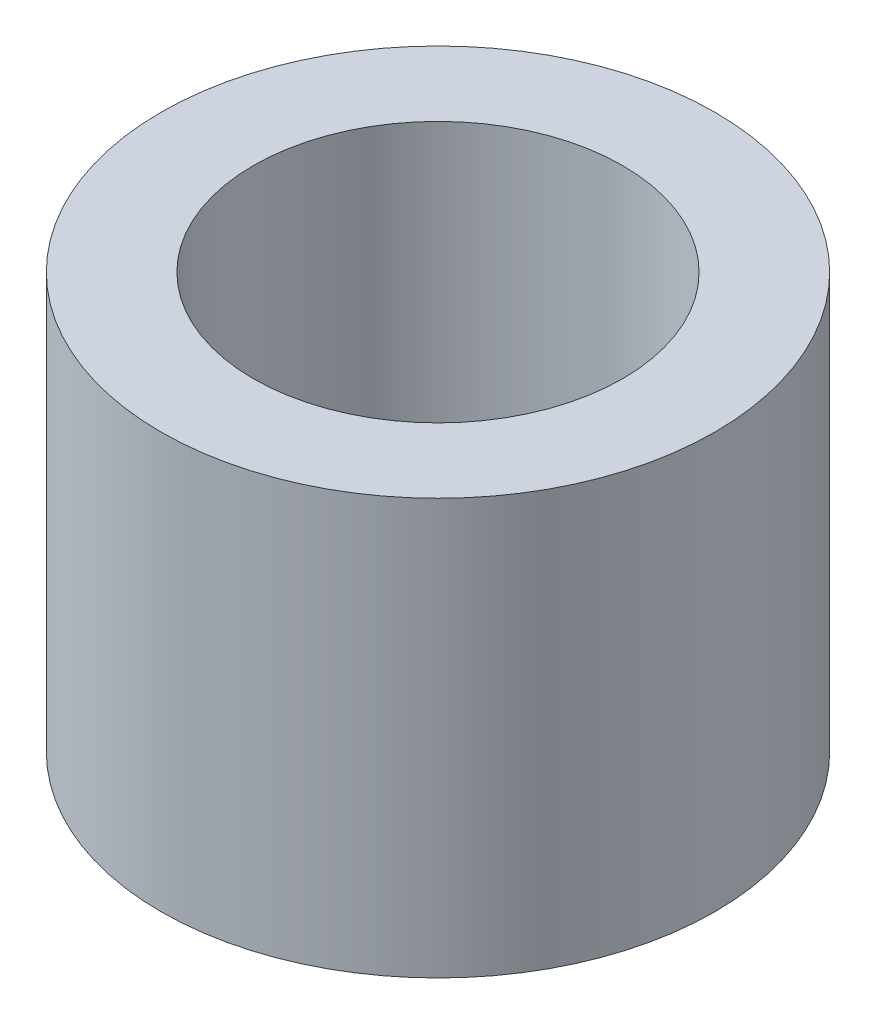
ISO-10303-21;
HEADER;
FILE_DESCRIPTION(('STEP AP214'),'2;1');
FILE_NAME('part.step','',(''),(''),'','','');
FILE_SCHEMA(('AUTOMOTIVE_DESIGN { 1 0 10303 214 1 1 1 1 }'));
ENDSEC;
DATA;
#1=APPLICATION_CONTEXT('core data for automotive mechanical design processes');
#2=APPLICATION_PROTOCOL_DEFINITION('international standard','automotive_design',2000,#1);
#3=PRODUCT_CONTEXT('',#1,'mechanical');
#4=PRODUCT('Part','Part','',(#3));
#5=PRODUCT_RELATED_PRODUCT_CATEGORY('part','',(#4));
#6=PRODUCT_DEFINITION_FORMATION('','',#4);
#7=PRODUCT_DEFINITION_CONTEXT('part definition',#1,'design');
#8=PRODUCT_DEFINITION('design','',#6,#7);
#9=PRODUCT_DEFINITION_SHAPE('','',#8);
#10=(LENGTH_UNIT() NAMED_UNIT(*) SI_UNIT(.MILLI.,.METRE.));
#11=(NAMED_UNIT(*) PLANE_ANGLE_UNIT() SI_UNIT($,.RADIAN.));
#12=(NAMED_UNIT(*) SI_UNIT($,.STERADIAN.) SOLID_ANGLE_UNIT());
#13=UNCERTAINTY_MEASURE_WITH_UNIT(LENGTH_MEASURE(1.E-05),#10,'distance_accuracy_value','');
#14=(GEOMETRIC_REPRESENTATION_CONTEXT(3) GLOBAL_UNCERTAINTY_ASSIGNED_CONTEXT((#13)) GLOBAL_UNIT_ASSIGNED_CONTEXT((#10,
#11,#12)) REPRESENTATION_CONTEXT('',''));
#15=CARTESIAN_POINT('',(0.,0.,0.));
#16=DIRECTION('',(0.,0.,1.));
#17=DIRECTION('',(1.,0.,0.));
#18=AXIS2_PLACEMENT_3D('',#15,#16,#17);
#19=CARTESIAN_POINT('',(0.,4.5,0.));
#20=DIRECTION('',(0.,1.,0.));
#21=DIRECTION('',(0.,0.,1.));
#22=AXIS2_PLACEMENT_3D('',#19,#20,#21);
#23=PLANE('',#22);
#24=CARTESIAN_POINT('',(0.,4.5,0.));
#25=DIRECTION('',(0.,1.,0.));
#26=DIRECTION('',(0.,0.,1.));
#27=AXIS2_PLACEMENT_3D('',#24,#25,#26);
#28=CIRCLE('',#27,3.);
#29=CARTESIAN_POINT('',(0.,4.5,3.));
#30=VERTEX_POINT('',#29);
#31=EDGE_CURVE('E10',#30,#30,#28,.T.);
#32=ORIENTED_EDGE('',*,*,#31,.T.);
#33=EDGE_LOOP('',(#32));
#34=FACE_BOUND('',#33,.T.);
#35=CARTESIAN_POINT('',(0.,4.5,0.));
#36=DIRECTION('',(0.,1.,0.));
#37=DIRECTION('',(0.,0.,1.));
#38=AXIS2_PLACEMENT_3D('',#35,#36,#37);
#39=CIRCLE('',#38,2.);
#40=CARTESIAN_POINT('',(0.,4.5,2.));
#41=VERTEX_POINT('',#40);
#42=EDGE_CURVE('E56',#41,#41,#39,.T.);
#43=ORIENTED_EDGE('',*,*,#42,.F.);
#44=EDGE_LOOP('',(#43));
#45=FACE_BOUND('',#44,.T.);
#46=ADVANCED_FACE('F43',(#34,#45),#23,.T.);
#47=CARTESIAN_POINT('',(0.,0.,0.));
#48=DIRECTION('',(0.,1.,0.));
#49=DIRECTION('',(0.,0.,1.));
#50=AXIS2_PLACEMENT_3D('',#47,#48,#49);
#51=PLANE('',#50);
#52=CARTESIAN_POINT('',(0.,0.,0.));
#53=DIRECTION('',(0.,1.,0.));
#54=DIRECTION('',(0.,0.,1.));
#55=AXIS2_PLACEMENT_3D('',#52,#53,#54);
#56=CIRCLE('',#55,3.);
#57=CARTESIAN_POINT('',(0.,0.,3.));
#58=VERTEX_POINT('',#57);
#59=EDGE_CURVE('E47',#58,#58,#56,.T.);
#60=ORIENTED_EDGE('',*,*,#59,.F.);
#61=EDGE_LOOP('',(#60));
#62=FACE_BOUND('',#61,.T.);
#63=CARTESIAN_POINT('',(0.,0.,0.));
#64=DIRECTION('',(0.,1.,0.));
#65=DIRECTION('',(0.,0.,1.));
#66=AXIS2_PLACEMENT_3D('',#63,#64,#65);
#67=CIRCLE('',#66,2.);
#68=CARTESIAN_POINT('',(0.,0.,2.));
#69=VERTEX_POINT('',#68);
#70=EDGE_CURVE('E58',#69,#69,#67,.T.);
#71=ORIENTED_EDGE('',*,*,#70,.T.);
#72=EDGE_LOOP('',(#71));
#73=FACE_BOUND('',#72,.T.);
#74=ADVANCED_FACE('F70',(#62,#73),#51,.F.);
#75=CARTESIAN_POINT('',(0.,4.5,0.));
#76=DIRECTION('',(0.,-1.,0.));
#77=DIRECTION('',(0.,0.,-1.));
#78=AXIS2_PLACEMENT_3D('',#75,#76,#77);
#79=CYLINDRICAL_SURFACE('',#78,3.);
#80=ORIENTED_EDGE('',*,*,#31,.F.);
#81=EDGE_LOOP('',(#80));
#82=FACE_BOUND('',#81,.T.);
#83=ORIENTED_EDGE('',*,*,#59,.T.);
#84=EDGE_LOOP('',(#83));
#85=FACE_BOUND('',#84,.T.);
#86=ADVANCED_FACE('F45',(#82,#85),#79,.T.);
#87=CARTESIAN_POINT('',(0.,4.5,0.));
#88=DIRECTION('',(0.,-1.,0.));
#89=DIRECTION('',(0.,0.,-1.));
#90=AXIS2_PLACEMENT_3D('',#87,#88,#89);
#91=CYLINDRICAL_SURFACE('',#90,2.);
#92=ORIENTED_EDGE('',*,*,#42,.T.);
#93=EDGE_LOOP('',(#92));
#94=FACE_BOUND('',#93,.T.);
#95=ORIENTED_EDGE('',*,*,#70,.F.);
#96=EDGE_LOOP('',(#95));
#97=FACE_BOUND('',#96,.T.);
#98=ADVANCED_FACE('F66',(#94,#97),#91,.F.);
#99=CLOSED_SHELL('',(#46,#74,#86,#98));
#100=MANIFOLD_SOLID_BREP('B2',#99);
#101=ADVANCED_BREP_SHAPE_REPRESENTATION('',(#18,#100),#14);
#102=SHAPE_DEFINITION_REPRESENTATION(#9,#101);
ENDSEC;
END-ISO-10303-21;
